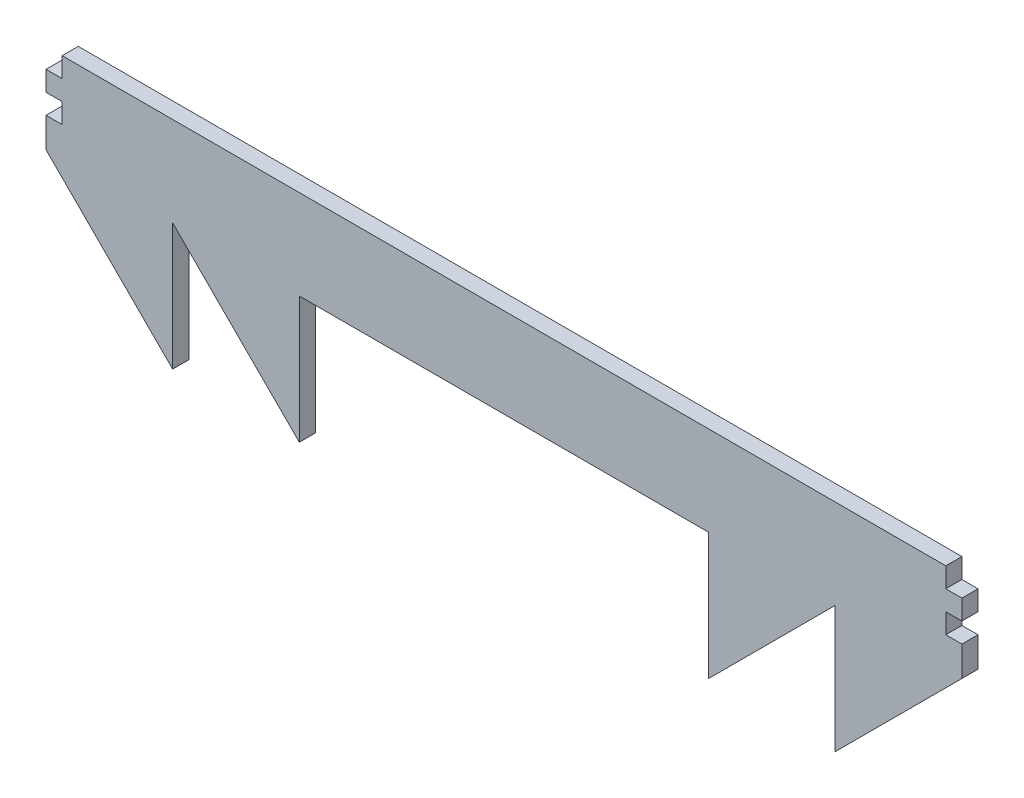
ISO-10303-21;
HEADER;
FILE_DESCRIPTION(('STEP AP214'),'2;1');
FILE_NAME('part.step','',(''),(''),'','','');
FILE_SCHEMA(('AUTOMOTIVE_DESIGN { 1 0 10303 214 1 1 1 1 }'));
ENDSEC;
DATA;
#1=APPLICATION_CONTEXT('core data for automotive mechanical design processes');
#2=APPLICATION_PROTOCOL_DEFINITION('international standard','automotive_design',2000,#1);
#3=PRODUCT_CONTEXT('',#1,'mechanical');
#4=PRODUCT('Part','Part','',(#3));
#5=PRODUCT_RELATED_PRODUCT_CATEGORY('part','',(#4));
#6=PRODUCT_DEFINITION_FORMATION('','',#4);
#7=PRODUCT_DEFINITION_CONTEXT('part definition',#1,'design');
#8=PRODUCT_DEFINITION('design','',#6,#7);
#9=PRODUCT_DEFINITION_SHAPE('','',#8);
#10=(LENGTH_UNIT() NAMED_UNIT(*) SI_UNIT(.MILLI.,.METRE.));
#11=(NAMED_UNIT(*) PLANE_ANGLE_UNIT() SI_UNIT($,.RADIAN.));
#12=(NAMED_UNIT(*) SI_UNIT($,.STERADIAN.) SOLID_ANGLE_UNIT());
#13=UNCERTAINTY_MEASURE_WITH_UNIT(LENGTH_MEASURE(1.E-05),#10,'distance_accuracy_value','');
#14=(GEOMETRIC_REPRESENTATION_CONTEXT(3) GLOBAL_UNCERTAINTY_ASSIGNED_CONTEXT((#13)) GLOBAL_UNIT_ASSIGNED_CONTEXT((#10,
#11,#12)) REPRESENTATION_CONTEXT('',''));
#15=CARTESIAN_POINT('',(0.,0.,0.));
#16=DIRECTION('',(0.,0.,1.));
#17=DIRECTION('',(1.,0.,0.));
#18=AXIS2_PLACEMENT_3D('',#15,#16,#17);
#19=CARTESIAN_POINT('',(76.7,-10.,2.7));
#20=DIRECTION('',(-0.707106781186547,0.707106781186548,0.));
#21=DIRECTION('',(-0.707106781186548,-0.707106781186547,0.));
#22=AXIS2_PLACEMENT_3D('',#19,#20,#21);
#23=PLANE('',#22);
#24=DIRECTION('',(0.707106781186548,0.707106781186547,0.));
#25=VECTOR('',#24,1.);
#26=CARTESIAN_POINT('',(76.7,-10.,0.));
#27=LINE('',#26,#25);
#28=CARTESIAN_POINT('',(55.4867965644036,-31.2132034355964,0.));
#29=VERTEX_POINT('',#28);
#30=CARTESIAN_POINT('',(76.7,-10.,0.));
#31=VERTEX_POINT('',#30);
#32=EDGE_CURVE('E225',#29,#31,#27,.T.);
#33=ORIENTED_EDGE('',*,*,#32,.T.);
#34=DIRECTION('',(0.,0.,-1.));
#35=VECTOR('',#34,1.);
#36=CARTESIAN_POINT('',(76.7,-10.,2.7));
#37=LINE('',#36,#35);
#38=CARTESIAN_POINT('',(76.7,-10.,2.7));
#39=VERTEX_POINT('',#38);
#40=EDGE_CURVE('E11',#39,#31,#37,.T.);
#41=ORIENTED_EDGE('',*,*,#40,.F.);
#42=DIRECTION('',(0.707106781186548,0.707106781186547,0.));
#43=VECTOR('',#42,1.);
#44=CARTESIAN_POINT('',(76.7,-10.,2.7));
#45=LINE('',#44,#43);
#46=CARTESIAN_POINT('',(55.4867965644036,-31.2132034355964,2.7));
#47=VERTEX_POINT('',#46);
#48=EDGE_CURVE('E271',#47,#39,#45,.T.);
#49=ORIENTED_EDGE('',*,*,#48,.F.);
#50=DIRECTION('',(0.,0.,-1.));
#51=VECTOR('',#50,1.);
#52=CARTESIAN_POINT('',(55.4867965644036,-31.2132034355964,2.7));
#53=LINE('',#52,#51);
#54=EDGE_CURVE('E221',#47,#29,#53,.T.);
#55=ORIENTED_EDGE('',*,*,#54,.T.);
#56=EDGE_LOOP('',(#33,#41,#49,#55));
#57=FACE_BOUND('',#56,.T.);
#58=ADVANCED_FACE('F33',(#57),#23,.F.);
#59=CARTESIAN_POINT('',(76.7,-10.,2.7));
#60=DIRECTION('',(-1.,0.,0.));
#61=DIRECTION('',(0.,0.,1.));
#62=AXIS2_PLACEMENT_3D('',#59,#60,#61);
#63=PLANE('',#62);
#64=DIRECTION('',(0.,1.,0.));
#65=VECTOR('',#64,1.);
#66=CARTESIAN_POINT('',(76.7,-10.,0.));
#67=LINE('',#66,#65);
#68=CARTESIAN_POINT('',(76.7,-5.,0.));
#69=VERTEX_POINT('',#68);
#70=EDGE_CURVE('E228',#31,#69,#67,.T.);
#71=ORIENTED_EDGE('',*,*,#70,.T.);
#72=DIRECTION('',(0.,0.,-1.));
#73=VECTOR('',#72,1.);
#74=CARTESIAN_POINT('',(76.7,-5.,2.7));
#75=LINE('',#74,#73);
#76=CARTESIAN_POINT('',(76.7,-5.,2.7));
#77=VERTEX_POINT('',#76);
#78=EDGE_CURVE('E41',#77,#69,#75,.T.);
#79=ORIENTED_EDGE('',*,*,#78,.F.);
#80=DIRECTION('',(0.,1.,0.));
#81=VECTOR('',#80,1.);
#82=CARTESIAN_POINT('',(76.7,-10.,2.7));
#83=LINE('',#82,#81);
#84=EDGE_CURVE('E140',#39,#77,#83,.T.);
#85=ORIENTED_EDGE('',*,*,#84,.F.);
#86=ORIENTED_EDGE('',*,*,#40,.T.);
#87=EDGE_LOOP('',(#71,#79,#85,#86));
#88=FACE_BOUND('',#87,.T.);
#89=ADVANCED_FACE('F409',(#88),#63,.F.);
#90=CARTESIAN_POINT('',(76.7,-5.,2.7));
#91=DIRECTION('',(0.,-1.,0.));
#92=DIRECTION('',(0.,0.,-1.));
#93=AXIS2_PLACEMENT_3D('',#90,#91,#92);
#94=PLANE('',#93);
#95=DIRECTION('',(-1.,0.,0.));
#96=VECTOR('',#95,1.);
#97=CARTESIAN_POINT('',(76.7,-5.,0.));
#98=LINE('',#97,#96);
#99=CARTESIAN_POINT('',(74.,-5.,0.));
#100=VERTEX_POINT('',#99);
#101=EDGE_CURVE('E230',#69,#100,#98,.T.);
#102=ORIENTED_EDGE('',*,*,#101,.T.);
#103=DIRECTION('',(0.,0.,-1.));
#104=VECTOR('',#103,1.);
#105=CARTESIAN_POINT('',(74.,-5.,2.7));
#106=LINE('',#105,#104);
#107=CARTESIAN_POINT('',(74.,-5.,2.7));
#108=VERTEX_POINT('',#107);
#109=EDGE_CURVE('E326',#108,#100,#106,.T.);
#110=ORIENTED_EDGE('',*,*,#109,.F.);
#111=DIRECTION('',(-1.,0.,0.));
#112=VECTOR('',#111,1.);
#113=CARTESIAN_POINT('',(76.7,-5.,2.7));
#114=LINE('',#113,#112);
#115=EDGE_CURVE('E334',#77,#108,#114,.T.);
#116=ORIENTED_EDGE('',*,*,#115,.F.);
#117=ORIENTED_EDGE('',*,*,#78,.T.);
#118=EDGE_LOOP('',(#102,#110,#116,#117));
#119=FACE_BOUND('',#118,.T.);
#120=ADVANCED_FACE('F332',(#119),#94,.F.);
#121=CARTESIAN_POINT('',(74.,-1.66666666666667,2.7));
#122=DIRECTION('',(-1.,0.,0.));
#123=DIRECTION('',(0.,0.,1.));
#124=AXIS2_PLACEMENT_3D('',#121,#122,#123);
#125=PLANE('',#124);
#126=DIRECTION('',(0.,1.,0.));
#127=VECTOR('',#126,1.);
#128=CARTESIAN_POINT('',(74.,-1.66666666666667,0.));
#129=LINE('',#128,#127);
#130=CARTESIAN_POINT('',(74.,-1.66666666666667,0.));
#131=VERTEX_POINT('',#130);
#132=EDGE_CURVE('E232',#100,#131,#129,.T.);
#133=ORIENTED_EDGE('',*,*,#132,.T.);
#134=DIRECTION('',(0.,0.,-1.));
#135=VECTOR('',#134,1.);
#136=CARTESIAN_POINT('',(74.,-1.66666666666667,2.7));
#137=LINE('',#136,#135);
#138=CARTESIAN_POINT('',(74.,-1.66666666666667,2.7));
#139=VERTEX_POINT('',#138);
#140=EDGE_CURVE('E323',#139,#131,#137,.T.);
#141=ORIENTED_EDGE('',*,*,#140,.F.);
#142=DIRECTION('',(0.,1.,0.));
#143=VECTOR('',#142,1.);
#144=CARTESIAN_POINT('',(74.,-1.66666666666667,2.7));
#145=LINE('',#144,#143);
#146=EDGE_CURVE('E352',#108,#139,#145,.T.);
#147=ORIENTED_EDGE('',*,*,#146,.F.);
#148=ORIENTED_EDGE('',*,*,#109,.T.);
#149=EDGE_LOOP('',(#133,#141,#147,#148));
#150=FACE_BOUND('',#149,.T.);
#151=ADVANCED_FACE('F343',(#150),#125,.F.);
#152=CARTESIAN_POINT('',(76.7,-1.66666666666667,2.7));
#153=DIRECTION('',(0.,1.,0.));
#154=DIRECTION('',(-1.,0.,0.));
#155=AXIS2_PLACEMENT_3D('',#152,#153,#154);
#156=PLANE('',#155);
#157=DIRECTION('',(1.,0.,0.));
#158=VECTOR('',#157,1.);
#159=CARTESIAN_POINT('',(76.7,-1.66666666666667,0.));
#160=LINE('',#159,#158);
#161=CARTESIAN_POINT('',(76.7,-1.66666666666667,0.));
#162=VERTEX_POINT('',#161);
#163=EDGE_CURVE('E234',#131,#162,#160,.T.);
#164=ORIENTED_EDGE('',*,*,#163,.T.);
#165=DIRECTION('',(0.,0.,-1.));
#166=VECTOR('',#165,1.);
#167=CARTESIAN_POINT('',(76.7,-1.66666666666667,2.7));
#168=LINE('',#167,#166);
#169=CARTESIAN_POINT('',(76.7,-1.66666666666667,2.7));
#170=VERTEX_POINT('',#169);
#171=EDGE_CURVE('E320',#170,#162,#168,.T.);
#172=ORIENTED_EDGE('',*,*,#171,.F.);
#173=DIRECTION('',(1.,0.,0.));
#174=VECTOR('',#173,1.);
#175=CARTESIAN_POINT('',(76.7,-1.66666666666667,2.7));
#176=LINE('',#175,#174);
#177=EDGE_CURVE('E349',#139,#170,#176,.T.);
#178=ORIENTED_EDGE('',*,*,#177,.F.);
#179=ORIENTED_EDGE('',*,*,#140,.T.);
#180=EDGE_LOOP('',(#164,#172,#178,#179));
#181=FACE_BOUND('',#180,.T.);
#182=ADVANCED_FACE('F347',(#181),#156,.F.);
#183=CARTESIAN_POINT('',(76.7,-1.66666666666667,2.7));
#184=DIRECTION('',(-1.,0.,0.));
#185=DIRECTION('',(0.,0.,1.));
#186=AXIS2_PLACEMENT_3D('',#183,#184,#185);
#187=PLANE('',#186);
#188=DIRECTION('',(0.,1.,0.));
#189=VECTOR('',#188,1.);
#190=CARTESIAN_POINT('',(76.7,-1.66666666666667,0.));
#191=LINE('',#190,#189);
#192=CARTESIAN_POINT('',(76.7,1.66666666666667,0.));
#193=VERTEX_POINT('',#192);
#194=EDGE_CURVE('E236',#162,#193,#191,.T.);
#195=ORIENTED_EDGE('',*,*,#194,.T.);
#196=DIRECTION('',(0.,0.,-1.));
#197=VECTOR('',#196,1.);
#198=CARTESIAN_POINT('',(76.7,1.66666666666667,2.7));
#199=LINE('',#198,#197);
#200=CARTESIAN_POINT('',(76.7,1.66666666666667,2.7));
#201=VERTEX_POINT('',#200);
#202=EDGE_CURVE('E317',#201,#193,#199,.T.);
#203=ORIENTED_EDGE('',*,*,#202,.F.);
#204=DIRECTION('',(0.,1.,0.));
#205=VECTOR('',#204,1.);
#206=CARTESIAN_POINT('',(76.7,-1.66666666666667,2.7));
#207=LINE('',#206,#205);
#208=EDGE_CURVE('E351',#170,#201,#207,.T.);
#209=ORIENTED_EDGE('',*,*,#208,.F.);
#210=ORIENTED_EDGE('',*,*,#171,.T.);
#211=EDGE_LOOP('',(#195,#203,#209,#210));
#212=FACE_BOUND('',#211,.T.);
#213=ADVANCED_FACE('F422',(#212),#187,.F.);
#214=CARTESIAN_POINT('',(76.7,1.66666666666667,2.7));
#215=DIRECTION('',(0.,-1.,0.));
#216=DIRECTION('',(1.,0.,0.));
#217=AXIS2_PLACEMENT_3D('',#214,#215,#216);
#218=PLANE('',#217);
#219=DIRECTION('',(-1.,0.,0.));
#220=VECTOR('',#219,1.);
#221=CARTESIAN_POINT('',(76.7,1.66666666666667,0.));
#222=LINE('',#221,#220);
#223=CARTESIAN_POINT('',(74.,1.66666666666667,0.));
#224=VERTEX_POINT('',#223);
#225=EDGE_CURVE('E238',#193,#224,#222,.T.);
#226=ORIENTED_EDGE('',*,*,#225,.T.);
#227=DIRECTION('',(0.,0.,-1.));
#228=VECTOR('',#227,1.);
#229=CARTESIAN_POINT('',(74.,1.66666666666667,2.7));
#230=LINE('',#229,#228);
#231=CARTESIAN_POINT('',(74.,1.66666666666667,2.7));
#232=VERTEX_POINT('',#231);
#233=EDGE_CURVE('E314',#232,#224,#230,.T.);
#234=ORIENTED_EDGE('',*,*,#233,.F.);
#235=DIRECTION('',(-1.,0.,0.));
#236=VECTOR('',#235,1.);
#237=CARTESIAN_POINT('',(76.7,1.66666666666667,2.7));
#238=LINE('',#237,#236);
#239=EDGE_CURVE('E354',#201,#232,#238,.T.);
#240=ORIENTED_EDGE('',*,*,#239,.F.);
#241=ORIENTED_EDGE('',*,*,#202,.T.);
#242=EDGE_LOOP('',(#226,#234,#240,#241));
#243=FACE_BOUND('',#242,.T.);
#244=ADVANCED_FACE('F425',(#243),#218,.F.);
#245=CARTESIAN_POINT('',(74.,1.66666666666667,2.7));
#246=DIRECTION('',(-1.,0.,0.));
#247=DIRECTION('',(0.,0.,1.));
#248=AXIS2_PLACEMENT_3D('',#245,#246,#247);
#249=PLANE('',#248);
#250=DIRECTION('',(0.,1.,0.));
#251=VECTOR('',#250,1.);
#252=CARTESIAN_POINT('',(74.,1.66666666666667,0.));
#253=LINE('',#252,#251);
#254=CARTESIAN_POINT('',(74.,5.,0.));
#255=VERTEX_POINT('',#254);
#256=EDGE_CURVE('E240',#224,#255,#253,.T.);
#257=ORIENTED_EDGE('',*,*,#256,.T.);
#258=DIRECTION('',(0.,0.,-1.));
#259=VECTOR('',#258,1.);
#260=CARTESIAN_POINT('',(74.,5.,2.7));
#261=LINE('',#260,#259);
#262=CARTESIAN_POINT('',(74.,5.,2.7));
#263=VERTEX_POINT('',#262);
#264=EDGE_CURVE('E311',#263,#255,#261,.T.);
#265=ORIENTED_EDGE('',*,*,#264,.F.);
#266=DIRECTION('',(0.,1.,0.));
#267=VECTOR('',#266,1.);
#268=CARTESIAN_POINT('',(74.,1.66666666666667,2.7));
#269=LINE('',#268,#267);
#270=EDGE_CURVE('E360',#232,#263,#269,.T.);
#271=ORIENTED_EDGE('',*,*,#270,.F.);
#272=ORIENTED_EDGE('',*,*,#233,.T.);
#273=EDGE_LOOP('',(#257,#265,#271,#272));
#274=FACE_BOUND('',#273,.T.);
#275=ADVANCED_FACE('F429',(#274),#249,.F.);
#276=CARTESIAN_POINT('',(74.,5.,2.7));
#277=DIRECTION('',(0.,-1.,0.));
#278=DIRECTION('',(1.,0.,0.));
#279=AXIS2_PLACEMENT_3D('',#276,#277,#278);
#280=PLANE('',#279);
#281=DIRECTION('',(-1.,0.,0.));
#282=VECTOR('',#281,1.);
#283=CARTESIAN_POINT('',(74.,5.,0.));
#284=LINE('',#283,#282);
#285=CARTESIAN_POINT('',(-74.,4.99999999999999,0.));
#286=VERTEX_POINT('',#285);
#287=EDGE_CURVE('E242',#255,#286,#284,.T.);
#288=ORIENTED_EDGE('',*,*,#287,.T.);
#289=DIRECTION('',(0.,0.,-1.));
#290=VECTOR('',#289,1.);
#291=CARTESIAN_POINT('',(-74.,4.99999999999999,2.7));
#292=LINE('',#291,#290);
#293=CARTESIAN_POINT('',(-74.,4.99999999999999,2.7));
#294=VERTEX_POINT('',#293);
#295=EDGE_CURVE('E308',#294,#286,#292,.T.);
#296=ORIENTED_EDGE('',*,*,#295,.F.);
#297=DIRECTION('',(-1.,0.,0.));
#298=VECTOR('',#297,1.);
#299=CARTESIAN_POINT('',(74.,5.,2.7));
#300=LINE('',#299,#298);
#301=EDGE_CURVE('E362',#263,#294,#300,.T.);
#302=ORIENTED_EDGE('',*,*,#301,.F.);
#303=ORIENTED_EDGE('',*,*,#264,.T.);
#304=EDGE_LOOP('',(#288,#296,#302,#303));
#305=FACE_BOUND('',#304,.T.);
#306=ADVANCED_FACE('F433',(#305),#280,.F.);
#307=CARTESIAN_POINT('',(-74.,1.66666666666665,2.7));
#308=DIRECTION('',(1.,0.,0.));
#309=DIRECTION('',(0.,0.,-1.));
#310=AXIS2_PLACEMENT_3D('',#307,#308,#309);
#311=PLANE('',#310);
#312=DIRECTION('',(0.,-1.,0.));
#313=VECTOR('',#312,1.);
#314=CARTESIAN_POINT('',(-74.,1.66666666666665,0.));
#315=LINE('',#314,#313);
#316=CARTESIAN_POINT('',(-74.,1.66666666666665,0.));
#317=VERTEX_POINT('',#316);
#318=EDGE_CURVE('E244',#286,#317,#315,.T.);
#319=ORIENTED_EDGE('',*,*,#318,.T.);
#320=DIRECTION('',(0.,0.,-1.));
#321=VECTOR('',#320,1.);
#322=CARTESIAN_POINT('',(-74.,1.66666666666665,2.7));
#323=LINE('',#322,#321);
#324=CARTESIAN_POINT('',(-74.,1.66666666666665,2.7));
#325=VERTEX_POINT('',#324);
#326=EDGE_CURVE('E305',#325,#317,#323,.T.);
#327=ORIENTED_EDGE('',*,*,#326,.F.);
#328=DIRECTION('',(0.,-1.,0.));
#329=VECTOR('',#328,1.);
#330=CARTESIAN_POINT('',(-74.,1.66666666666665,2.7));
#331=LINE('',#330,#329);
#332=EDGE_CURVE('E364',#294,#325,#331,.T.);
#333=ORIENTED_EDGE('',*,*,#332,.F.);
#334=ORIENTED_EDGE('',*,*,#295,.T.);
#335=EDGE_LOOP('',(#319,#327,#333,#334));
#336=FACE_BOUND('',#335,.T.);
#337=ADVANCED_FACE('F437',(#336),#311,.F.);
#338=CARTESIAN_POINT('',(-76.7,1.66666666666665,2.7));
#339=DIRECTION('',(0.,-1.,0.));
#340=DIRECTION('',(1.,0.,0.));
#341=AXIS2_PLACEMENT_3D('',#338,#339,#340);
#342=PLANE('',#341);
#343=DIRECTION('',(-1.,0.,0.));
#344=VECTOR('',#343,1.);
#345=CARTESIAN_POINT('',(-76.7,1.66666666666665,0.));
#346=LINE('',#345,#344);
#347=CARTESIAN_POINT('',(-76.7,1.66666666666665,0.));
#348=VERTEX_POINT('',#347);
#349=EDGE_CURVE('E246',#317,#348,#346,.T.);
#350=ORIENTED_EDGE('',*,*,#349,.T.);
#351=DIRECTION('',(0.,0.,-1.));
#352=VECTOR('',#351,1.);
#353=CARTESIAN_POINT('',(-76.7,1.66666666666665,2.7));
#354=LINE('',#353,#352);
#355=CARTESIAN_POINT('',(-76.7,1.66666666666665,2.7));
#356=VERTEX_POINT('',#355);
#357=EDGE_CURVE('E302',#356,#348,#354,.T.);
#358=ORIENTED_EDGE('',*,*,#357,.F.);
#359=DIRECTION('',(-1.,0.,0.));
#360=VECTOR('',#359,1.);
#361=CARTESIAN_POINT('',(-76.7,1.66666666666665,2.7));
#362=LINE('',#361,#360);
#363=EDGE_CURVE('E366',#325,#356,#362,.T.);
#364=ORIENTED_EDGE('',*,*,#363,.F.);
#365=ORIENTED_EDGE('',*,*,#326,.T.);
#366=EDGE_LOOP('',(#350,#358,#364,#365));
#367=FACE_BOUND('',#366,.T.);
#368=ADVANCED_FACE('F441',(#367),#342,.F.);
#369=CARTESIAN_POINT('',(-76.7,-1.66666666666668,2.7));
#370=DIRECTION('',(1.,0.,0.));
#371=DIRECTION('',(0.,0.,-1.));
#372=AXIS2_PLACEMENT_3D('',#369,#370,#371);
#373=PLANE('',#372);
#374=DIRECTION('',(0.,-1.,0.));
#375=VECTOR('',#374,1.);
#376=CARTESIAN_POINT('',(-76.7,-1.66666666666668,0.));
#377=LINE('',#376,#375);
#378=CARTESIAN_POINT('',(-76.7,-1.66666666666668,0.));
#379=VERTEX_POINT('',#378);
#380=EDGE_CURVE('E248',#348,#379,#377,.T.);
#381=ORIENTED_EDGE('',*,*,#380,.T.);
#382=DIRECTION('',(0.,0.,-1.));
#383=VECTOR('',#382,1.);
#384=CARTESIAN_POINT('',(-76.7,-1.66666666666668,2.7));
#385=LINE('',#384,#383);
#386=CARTESIAN_POINT('',(-76.7,-1.66666666666668,2.7));
#387=VERTEX_POINT('',#386);
#388=EDGE_CURVE('E299',#387,#379,#385,.T.);
#389=ORIENTED_EDGE('',*,*,#388,.F.);
#390=DIRECTION('',(0.,-1.,0.));
#391=VECTOR('',#390,1.);
#392=CARTESIAN_POINT('',(-76.7,-1.66666666666668,2.7));
#393=LINE('',#392,#391);
#394=EDGE_CURVE('E368',#356,#387,#393,.T.);
#395=ORIENTED_EDGE('',*,*,#394,.F.);
#396=ORIENTED_EDGE('',*,*,#357,.T.);
#397=EDGE_LOOP('',(#381,#389,#395,#396));
#398=FACE_BOUND('',#397,.T.);
#399=ADVANCED_FACE('F445',(#398),#373,.F.);
#400=CARTESIAN_POINT('',(-76.7,-1.66666666666668,2.7));
#401=DIRECTION('',(0.,1.,0.));
#402=DIRECTION('',(0.,0.,1.));
#403=AXIS2_PLACEMENT_3D('',#400,#401,#402);
#404=PLANE('',#403);
#405=DIRECTION('',(1.,0.,0.));
#406=VECTOR('',#405,1.);
#407=CARTESIAN_POINT('',(-76.7,-1.66666666666668,0.));
#408=LINE('',#407,#406);
#409=CARTESIAN_POINT('',(-74.,-1.66666666666668,0.));
#410=VERTEX_POINT('',#409);
#411=EDGE_CURVE('E250',#379,#410,#408,.T.);
#412=ORIENTED_EDGE('',*,*,#411,.T.);
#413=DIRECTION('',(0.,0.,-1.));
#414=VECTOR('',#413,1.);
#415=CARTESIAN_POINT('',(-74.,-1.66666666666668,2.7));
#416=LINE('',#415,#414);
#417=CARTESIAN_POINT('',(-74.,-1.66666666666668,2.7));
#418=VERTEX_POINT('',#417);
#419=EDGE_CURVE('E296',#418,#410,#416,.T.);
#420=ORIENTED_EDGE('',*,*,#419,.F.);
#421=DIRECTION('',(1.,0.,0.));
#422=VECTOR('',#421,1.);
#423=CARTESIAN_POINT('',(-76.7,-1.66666666666668,2.7));
#424=LINE('',#423,#422);
#425=EDGE_CURVE('E370',#387,#418,#424,.T.);
#426=ORIENTED_EDGE('',*,*,#425,.F.);
#427=ORIENTED_EDGE('',*,*,#388,.T.);
#428=EDGE_LOOP('',(#412,#420,#426,#427));
#429=FACE_BOUND('',#428,.T.);
#430=ADVANCED_FACE('F449',(#429),#404,.F.);
#431=CARTESIAN_POINT('',(-74.,-1.66666666666668,2.7));
#432=DIRECTION('',(1.,0.,0.));
#433=DIRECTION('',(0.,0.,-1.));
#434=AXIS2_PLACEMENT_3D('',#431,#432,#433);
#435=PLANE('',#434);
#436=DIRECTION('',(0.,-1.,0.));
#437=VECTOR('',#436,1.);
#438=CARTESIAN_POINT('',(-74.,-1.66666666666668,0.));
#439=LINE('',#438,#437);
#440=CARTESIAN_POINT('',(-74.,-5.00000000000002,0.));
#441=VERTEX_POINT('',#440);
#442=EDGE_CURVE('E252',#410,#441,#439,.T.);
#443=ORIENTED_EDGE('',*,*,#442,.T.);
#444=DIRECTION('',(0.,0.,-1.));
#445=VECTOR('',#444,1.);
#446=CARTESIAN_POINT('',(-74.,-5.00000000000002,2.7));
#447=LINE('',#446,#445);
#448=CARTESIAN_POINT('',(-74.,-5.00000000000002,2.7));
#449=VERTEX_POINT('',#448);
#450=EDGE_CURVE('E293',#449,#441,#447,.T.);
#451=ORIENTED_EDGE('',*,*,#450,.F.);
#452=DIRECTION('',(0.,-1.,0.));
#453=VECTOR('',#452,1.);
#454=CARTESIAN_POINT('',(-74.,-1.66666666666668,2.7));
#455=LINE('',#454,#453);
#456=EDGE_CURVE('E372',#418,#449,#455,.T.);
#457=ORIENTED_EDGE('',*,*,#456,.F.);
#458=ORIENTED_EDGE('',*,*,#419,.T.);
#459=EDGE_LOOP('',(#443,#451,#457,#458));
#460=FACE_BOUND('',#459,.T.);
#461=ADVANCED_FACE('F453',(#460),#435,.F.);
#462=CARTESIAN_POINT('',(-74.,-5.00000000000002,2.7));
#463=DIRECTION('',(0.,-1.,0.));
#464=DIRECTION('',(0.,0.,-1.));
#465=AXIS2_PLACEMENT_3D('',#462,#463,#464);
#466=PLANE('',#465);
#467=DIRECTION('',(-1.,0.,0.));
#468=VECTOR('',#467,1.);
#469=CARTESIAN_POINT('',(-74.,-5.00000000000002,0.));
#470=LINE('',#469,#468);
#471=CARTESIAN_POINT('',(-76.7,-5.00000000000002,0.));
#472=VERTEX_POINT('',#471);
#473=EDGE_CURVE('E254',#441,#472,#470,.T.);
#474=ORIENTED_EDGE('',*,*,#473,.T.);
#475=DIRECTION('',(0.,0.,-1.));
#476=VECTOR('',#475,1.);
#477=CARTESIAN_POINT('',(-76.7,-5.00000000000002,2.7));
#478=LINE('',#477,#476);
#479=CARTESIAN_POINT('',(-76.7,-5.00000000000002,2.7));
#480=VERTEX_POINT('',#479);
#481=EDGE_CURVE('E290',#480,#472,#478,.T.);
#482=ORIENTED_EDGE('',*,*,#481,.F.);
#483=DIRECTION('',(-1.,0.,0.));
#484=VECTOR('',#483,1.);
#485=CARTESIAN_POINT('',(-74.,-5.00000000000002,2.7));
#486=LINE('',#485,#484);
#487=EDGE_CURVE('E374',#449,#480,#486,.T.);
#488=ORIENTED_EDGE('',*,*,#487,.F.);
#489=ORIENTED_EDGE('',*,*,#450,.T.);
#490=EDGE_LOOP('',(#474,#482,#488,#489));
#491=FACE_BOUND('',#490,.T.);
#492=ADVANCED_FACE('F457',(#491),#466,.F.);
#493=CARTESIAN_POINT('',(-76.7,-5.00000000000002,2.7));
#494=DIRECTION('',(1.,0.,0.));
#495=DIRECTION('',(0.,0.,-1.));
#496=AXIS2_PLACEMENT_3D('',#493,#494,#495);
#497=PLANE('',#496);
#498=DIRECTION('',(0.,-1.,0.));
#499=VECTOR('',#498,1.);
#500=CARTESIAN_POINT('',(-76.7,-5.00000000000002,0.));
#501=LINE('',#500,#499);
#502=CARTESIAN_POINT('',(-76.7,-10.,0.));
#503=VERTEX_POINT('',#502);
#504=EDGE_CURVE('E256',#472,#503,#501,.T.);
#505=ORIENTED_EDGE('',*,*,#504,.T.);
#506=DIRECTION('',(0.,0.,-1.));
#507=VECTOR('',#506,1.);
#508=CARTESIAN_POINT('',(-76.7,-10.,2.7));
#509=LINE('',#508,#507);
#510=CARTESIAN_POINT('',(-76.7,-10.,2.7));
#511=VERTEX_POINT('',#510);
#512=EDGE_CURVE('E287',#511,#503,#509,.T.);
#513=ORIENTED_EDGE('',*,*,#512,.F.);
#514=DIRECTION('',(0.,-1.,0.));
#515=VECTOR('',#514,1.);
#516=CARTESIAN_POINT('',(-76.7,-5.00000000000002,2.7));
#517=LINE('',#516,#515);
#518=EDGE_CURVE('E376',#480,#511,#517,.T.);
#519=ORIENTED_EDGE('',*,*,#518,.F.);
#520=ORIENTED_EDGE('',*,*,#481,.T.);
#521=EDGE_LOOP('',(#505,#513,#519,#520));
#522=FACE_BOUND('',#521,.T.);
#523=ADVANCED_FACE('F461',(#522),#497,.F.);
#524=CARTESIAN_POINT('',(-76.7,-10.,2.7));
#525=DIRECTION('',(0.707106781186548,0.707106781186547,0.));
#526=DIRECTION('',(-0.707106781186547,0.707106781186548,0.));
#527=AXIS2_PLACEMENT_3D('',#524,#525,#526);
#528=PLANE('',#527);
#529=DIRECTION('',(0.707106781186547,-0.707106781186547,0.));
#530=VECTOR('',#529,1.);
#531=CARTESIAN_POINT('',(-76.7,-10.,0.));
#532=LINE('',#531,#530);
#533=CARTESIAN_POINT('',(-55.4867965644036,-31.2132034355964,0.));
#534=VERTEX_POINT('',#533);
#535=EDGE_CURVE('E258',#503,#534,#532,.T.);
#536=ORIENTED_EDGE('',*,*,#535,.T.);
#537=DIRECTION('',(0.,0.,-1.));
#538=VECTOR('',#537,1.);
#539=CARTESIAN_POINT('',(-55.4867965644036,-31.2132034355964,2.7));
#540=LINE('',#539,#538);
#541=CARTESIAN_POINT('',(-55.4867965644036,-31.2132034355964,2.7));
#542=VERTEX_POINT('',#541);
#543=EDGE_CURVE('E284',#542,#534,#540,.T.);
#544=ORIENTED_EDGE('',*,*,#543,.F.);
#545=DIRECTION('',(0.707106781186547,-0.707106781186547,0.));
#546=VECTOR('',#545,1.);
#547=CARTESIAN_POINT('',(-76.7,-10.,2.7));
#548=LINE('',#547,#546);
#549=EDGE_CURVE('E378',#511,#542,#548,.T.);
#550=ORIENTED_EDGE('',*,*,#549,.F.);
#551=ORIENTED_EDGE('',*,*,#512,.T.);
#552=EDGE_LOOP('',(#536,#544,#550,#551));
#553=FACE_BOUND('',#552,.T.);
#554=ADVANCED_FACE('F465',(#553),#528,.F.);
#555=CARTESIAN_POINT('',(-55.4867965644036,-31.2132034355964,2.7));
#556=DIRECTION('',(-1.,0.,0.));
#557=DIRECTION('',(0.,0.,1.));
#558=AXIS2_PLACEMENT_3D('',#555,#556,#557);
#559=PLANE('',#558);
#560=DIRECTION('',(0.,1.,0.));
#561=VECTOR('',#560,1.);
#562=CARTESIAN_POINT('',(-55.4867965644036,-31.2132034355964,0.));
#563=LINE('',#562,#561);
#564=CARTESIAN_POINT('',(-55.4867965644036,-10.,0.));
#565=VERTEX_POINT('',#564);
#566=EDGE_CURVE('E260',#534,#565,#563,.T.);
#567=ORIENTED_EDGE('',*,*,#566,.T.);
#568=DIRECTION('',(0.,0.,-1.));
#569=VECTOR('',#568,1.);
#570=CARTESIAN_POINT('',(-55.4867965644036,-10.,2.7));
#571=LINE('',#570,#569);
#572=CARTESIAN_POINT('',(-55.4867965644036,-10.,2.7));
#573=VERTEX_POINT('',#572);
#574=EDGE_CURVE('E281',#573,#565,#571,.T.);
#575=ORIENTED_EDGE('',*,*,#574,.F.);
#576=DIRECTION('',(0.,1.,0.));
#577=VECTOR('',#576,1.);
#578=CARTESIAN_POINT('',(-55.4867965644036,-31.2132034355964,2.7));
#579=LINE('',#578,#577);
#580=EDGE_CURVE('E380',#542,#573,#579,.T.);
#581=ORIENTED_EDGE('',*,*,#580,.F.);
#582=ORIENTED_EDGE('',*,*,#543,.T.);
#583=EDGE_LOOP('',(#567,#575,#581,#582));
#584=FACE_BOUND('',#583,.T.);
#585=ADVANCED_FACE('F469',(#584),#559,.F.);
#586=CARTESIAN_POINT('',(-55.4867965644036,-10.,2.7));
#587=DIRECTION('',(0.707106781186547,0.707106781186548,0.));
#588=DIRECTION('',(-0.707106781186548,0.707106781186547,0.));
#589=AXIS2_PLACEMENT_3D('',#586,#587,#588);
#590=PLANE('',#589);
#591=DIRECTION('',(0.707106781186548,-0.707106781186547,0.));
#592=VECTOR('',#591,1.);
#593=CARTESIAN_POINT('',(-55.4867965644036,-10.,0.));
#594=LINE('',#593,#592);
#595=CARTESIAN_POINT('',(-34.2735931288071,-31.2132034355964,0.));
#596=VERTEX_POINT('',#595);
#597=EDGE_CURVE('E262',#565,#596,#594,.T.);
#598=ORIENTED_EDGE('',*,*,#597,.T.);
#599=DIRECTION('',(0.,0.,-1.));
#600=VECTOR('',#599,1.);
#601=CARTESIAN_POINT('',(-34.2735931288071,-31.2132034355964,2.7));
#602=LINE('',#601,#600);
#603=CARTESIAN_POINT('',(-34.2735931288071,-31.2132034355964,2.7));
#604=VERTEX_POINT('',#603);
#605=EDGE_CURVE('E278',#604,#596,#602,.T.);
#606=ORIENTED_EDGE('',*,*,#605,.F.);
#607=DIRECTION('',(0.707106781186548,-0.707106781186547,0.));
#608=VECTOR('',#607,1.);
#609=CARTESIAN_POINT('',(-55.4867965644036,-10.,2.7));
#610=LINE('',#609,#608);
#611=EDGE_CURVE('E382',#573,#604,#610,.T.);
#612=ORIENTED_EDGE('',*,*,#611,.F.);
#613=ORIENTED_EDGE('',*,*,#574,.T.);
#614=EDGE_LOOP('',(#598,#606,#612,#613));
#615=FACE_BOUND('',#614,.T.);
#616=ADVANCED_FACE('F473',(#615),#590,.F.);
#617=CARTESIAN_POINT('',(-34.2735931288071,-31.2132034355964,2.7));
#618=DIRECTION('',(-1.,0.,0.));
#619=DIRECTION('',(0.,0.,1.));
#620=AXIS2_PLACEMENT_3D('',#617,#618,#619);
#621=PLANE('',#620);
#622=DIRECTION('',(0.,1.,0.));
#623=VECTOR('',#622,1.);
#624=CARTESIAN_POINT('',(-34.2735931288071,-31.2132034355964,0.));
#625=LINE('',#624,#623);
#626=CARTESIAN_POINT('',(-34.2735931288071,-10.,0.));
#627=VERTEX_POINT('',#626);
#628=EDGE_CURVE('E264',#596,#627,#625,.T.);
#629=ORIENTED_EDGE('',*,*,#628,.T.);
#630=DIRECTION('',(0.,0.,-1.));
#631=VECTOR('',#630,1.);
#632=CARTESIAN_POINT('',(-34.2735931288071,-10.,2.7));
#633=LINE('',#632,#631);
#634=CARTESIAN_POINT('',(-34.2735931288071,-10.,2.7));
#635=VERTEX_POINT('',#634);
#636=EDGE_CURVE('E275',#635,#627,#633,.T.);
#637=ORIENTED_EDGE('',*,*,#636,.F.);
#638=DIRECTION('',(0.,1.,0.));
#639=VECTOR('',#638,1.);
#640=CARTESIAN_POINT('',(-34.2735931288071,-31.2132034355964,2.7));
#641=LINE('',#640,#639);
#642=EDGE_CURVE('E384',#604,#635,#641,.T.);
#643=ORIENTED_EDGE('',*,*,#642,.F.);
#644=ORIENTED_EDGE('',*,*,#605,.T.);
#645=EDGE_LOOP('',(#629,#637,#643,#644));
#646=FACE_BOUND('',#645,.T.);
#647=ADVANCED_FACE('F390',(#646),#621,.F.);
#648=CARTESIAN_POINT('',(-34.2735931288071,-10.,2.7));
#649=DIRECTION('',(0.,1.,0.));
#650=DIRECTION('',(0.,0.,1.));
#651=AXIS2_PLACEMENT_3D('',#648,#649,#650);
#652=PLANE('',#651);
#653=DIRECTION('',(1.,0.,0.));
#654=VECTOR('',#653,1.);
#655=CARTESIAN_POINT('',(-34.2735931288071,-10.,0.));
#656=LINE('',#655,#654);
#657=CARTESIAN_POINT('',(34.2735931288071,-10.,0.));
#658=VERTEX_POINT('',#657);
#659=EDGE_CURVE('E266',#627,#658,#656,.T.);
#660=ORIENTED_EDGE('',*,*,#659,.T.);
#661=DIRECTION('',(0.,0.,-1.));
#662=VECTOR('',#661,1.);
#663=CARTESIAN_POINT('',(34.2735931288071,-10.,2.7));
#664=LINE('',#663,#662);
#665=CARTESIAN_POINT('',(34.2735931288071,-10.,2.7));
#666=VERTEX_POINT('',#665);
#667=EDGE_CURVE('E216',#666,#658,#664,.T.);
#668=ORIENTED_EDGE('',*,*,#667,.F.);
#669=DIRECTION('',(1.,0.,0.));
#670=VECTOR('',#669,1.);
#671=CARTESIAN_POINT('',(-34.2735931288071,-10.,2.7));
#672=LINE('',#671,#670);
#673=EDGE_CURVE('E207',#635,#666,#672,.T.);
#674=ORIENTED_EDGE('',*,*,#673,.F.);
#675=ORIENTED_EDGE('',*,*,#636,.T.);
#676=EDGE_LOOP('',(#660,#668,#674,#675));
#677=FACE_BOUND('',#676,.T.);
#678=ADVANCED_FACE('F394',(#677),#652,.F.);
#679=CARTESIAN_POINT('',(34.2735931288071,-31.2132034355964,2.7));
#680=DIRECTION('',(1.,0.,0.));
#681=DIRECTION('',(0.,0.,-1.));
#682=AXIS2_PLACEMENT_3D('',#679,#680,#681);
#683=PLANE('',#682);
#684=DIRECTION('',(0.,-1.,0.));
#685=VECTOR('',#684,1.);
#686=CARTESIAN_POINT('',(34.2735931288071,-31.2132034355964,0.));
#687=LINE('',#686,#685);
#688=CARTESIAN_POINT('',(34.2735931288071,-31.2132034355964,0.));
#689=VERTEX_POINT('',#688);
#690=EDGE_CURVE('E215',#658,#689,#687,.T.);
#691=ORIENTED_EDGE('',*,*,#690,.T.);
#692=DIRECTION('',(0.,0.,-1.));
#693=VECTOR('',#692,1.);
#694=CARTESIAN_POINT('',(34.2735931288071,-31.2132034355964,2.7));
#695=LINE('',#694,#693);
#696=CARTESIAN_POINT('',(34.2735931288071,-31.2132034355964,2.7));
#697=VERTEX_POINT('',#696);
#698=EDGE_CURVE('E212',#697,#689,#695,.T.);
#699=ORIENTED_EDGE('',*,*,#698,.F.);
#700=DIRECTION('',(0.,-1.,0.));
#701=VECTOR('',#700,1.);
#702=CARTESIAN_POINT('',(34.2735931288071,-31.2132034355964,2.7));
#703=LINE('',#702,#701);
#704=EDGE_CURVE('E201',#666,#697,#703,.T.);
#705=ORIENTED_EDGE('',*,*,#704,.F.);
#706=ORIENTED_EDGE('',*,*,#667,.T.);
#707=EDGE_LOOP('',(#691,#699,#705,#706));
#708=FACE_BOUND('',#707,.T.);
#709=ADVANCED_FACE('F213',(#708),#683,.F.);
#710=CARTESIAN_POINT('',(55.4867965644036,-10.,2.7));
#711=DIRECTION('',(-0.707106781186547,0.707106781186548,0.));
#712=DIRECTION('',(-0.707106781186548,-0.707106781186547,0.));
#713=AXIS2_PLACEMENT_3D('',#710,#711,#712);
#714=PLANE('',#713);
#715=DIRECTION('',(0.707106781186548,0.707106781186547,0.));
#716=VECTOR('',#715,1.);
#717=CARTESIAN_POINT('',(55.4867965644036,-10.,0.));
#718=LINE('',#717,#716);
#719=CARTESIAN_POINT('',(55.4867965644036,-10.,0.));
#720=VERTEX_POINT('',#719);
#721=EDGE_CURVE('E126',#689,#720,#718,.T.);
#722=ORIENTED_EDGE('',*,*,#721,.T.);
#723=DIRECTION('',(0.,0.,-1.));
#724=VECTOR('',#723,1.);
#725=CARTESIAN_POINT('',(55.4867965644036,-10.,2.7));
#726=LINE('',#725,#724);
#727=CARTESIAN_POINT('',(55.4867965644036,-10.,2.7));
#728=VERTEX_POINT('',#727);
#729=EDGE_CURVE('E217',#728,#720,#726,.T.);
#730=ORIENTED_EDGE('',*,*,#729,.F.);
#731=DIRECTION('',(0.707106781186548,0.707106781186547,0.));
#732=VECTOR('',#731,1.);
#733=CARTESIAN_POINT('',(55.4867965644036,-10.,2.7));
#734=LINE('',#733,#732);
#735=EDGE_CURVE('E205',#697,#728,#734,.T.);
#736=ORIENTED_EDGE('',*,*,#735,.F.);
#737=ORIENTED_EDGE('',*,*,#698,.T.);
#738=EDGE_LOOP('',(#722,#730,#736,#737));
#739=FACE_BOUND('',#738,.T.);
#740=ADVANCED_FACE('F219',(#739),#714,.F.);
#741=CARTESIAN_POINT('',(55.4867965644036,-31.2132034355964,2.7));
#742=DIRECTION('',(1.,0.,0.));
#743=DIRECTION('',(0.,0.,-1.));
#744=AXIS2_PLACEMENT_3D('',#741,#742,#743);
#745=PLANE('',#744);
#746=DIRECTION('',(0.,-1.,0.));
#747=VECTOR('',#746,1.);
#748=CARTESIAN_POINT('',(55.4867965644036,-31.2132034355964,0.));
#749=LINE('',#748,#747);
#750=EDGE_CURVE('E132',#720,#29,#749,.T.);
#751=ORIENTED_EDGE('',*,*,#750,.T.);
#752=ORIENTED_EDGE('',*,*,#54,.F.);
#753=DIRECTION('',(0.,-1.,0.));
#754=VECTOR('',#753,1.);
#755=CARTESIAN_POINT('',(55.4867965644036,-31.2132034355964,2.7));
#756=LINE('',#755,#754);
#757=EDGE_CURVE('E49',#728,#47,#756,.T.);
#758=ORIENTED_EDGE('',*,*,#757,.F.);
#759=ORIENTED_EDGE('',*,*,#729,.T.);
#760=EDGE_LOOP('',(#751,#752,#758,#759));
#761=FACE_BOUND('',#760,.T.);
#762=ADVANCED_FACE('F398',(#761),#745,.F.);
#763=CARTESIAN_POINT('',(0.,0.,2.7));
#764=DIRECTION('',(0.,0.,1.));
#765=DIRECTION('',(1.,0.,0.));
#766=AXIS2_PLACEMENT_3D('',#763,#764,#765);
#767=PLANE('',#766);
#768=ORIENTED_EDGE('',*,*,#48,.T.);
#769=ORIENTED_EDGE('',*,*,#84,.T.);
#770=ORIENTED_EDGE('',*,*,#115,.T.);
#771=ORIENTED_EDGE('',*,*,#146,.T.);
#772=ORIENTED_EDGE('',*,*,#177,.T.);
#773=ORIENTED_EDGE('',*,*,#208,.T.);
#774=ORIENTED_EDGE('',*,*,#239,.T.);
#775=ORIENTED_EDGE('',*,*,#270,.T.);
#776=ORIENTED_EDGE('',*,*,#301,.T.);
#777=ORIENTED_EDGE('',*,*,#332,.T.);
#778=ORIENTED_EDGE('',*,*,#363,.T.);
#779=ORIENTED_EDGE('',*,*,#394,.T.);
#780=ORIENTED_EDGE('',*,*,#425,.T.);
#781=ORIENTED_EDGE('',*,*,#456,.T.);
#782=ORIENTED_EDGE('',*,*,#487,.T.);
#783=ORIENTED_EDGE('',*,*,#518,.T.);
#784=ORIENTED_EDGE('',*,*,#549,.T.);
#785=ORIENTED_EDGE('',*,*,#580,.T.);
#786=ORIENTED_EDGE('',*,*,#611,.T.);
#787=ORIENTED_EDGE('',*,*,#642,.T.);
#788=ORIENTED_EDGE('',*,*,#673,.T.);
#789=ORIENTED_EDGE('',*,*,#704,.T.);
#790=ORIENTED_EDGE('',*,*,#735,.T.);
#791=ORIENTED_EDGE('',*,*,#757,.T.);
#792=EDGE_LOOP('',(#768,#769,#770,#771,#772,#773,#774,#775,#776,#777,#778,#779,#780,#781,#782,
#783,#784,#785,#786,#787,#788,#789,#790,#791));
#793=FACE_BOUND('',#792,.T.);
#794=ADVANCED_FACE('F203',(#793),#767,.T.);
#795=CARTESIAN_POINT('',(0.,0.,0.));
#796=DIRECTION('',(0.,0.,1.));
#797=DIRECTION('',(1.,0.,0.));
#798=AXIS2_PLACEMENT_3D('',#795,#796,#797);
#799=PLANE('',#798);
#800=ORIENTED_EDGE('',*,*,#32,.F.);
#801=ORIENTED_EDGE('',*,*,#750,.F.);
#802=ORIENTED_EDGE('',*,*,#721,.F.);
#803=ORIENTED_EDGE('',*,*,#690,.F.);
#804=ORIENTED_EDGE('',*,*,#659,.F.);
#805=ORIENTED_EDGE('',*,*,#628,.F.);
#806=ORIENTED_EDGE('',*,*,#597,.F.);
#807=ORIENTED_EDGE('',*,*,#566,.F.);
#808=ORIENTED_EDGE('',*,*,#535,.F.);
#809=ORIENTED_EDGE('',*,*,#504,.F.);
#810=ORIENTED_EDGE('',*,*,#473,.F.);
#811=ORIENTED_EDGE('',*,*,#442,.F.);
#812=ORIENTED_EDGE('',*,*,#411,.F.);
#813=ORIENTED_EDGE('',*,*,#380,.F.);
#814=ORIENTED_EDGE('',*,*,#349,.F.);
#815=ORIENTED_EDGE('',*,*,#318,.F.);
#816=ORIENTED_EDGE('',*,*,#287,.F.);
#817=ORIENTED_EDGE('',*,*,#256,.F.);
#818=ORIENTED_EDGE('',*,*,#225,.F.);
#819=ORIENTED_EDGE('',*,*,#194,.F.);
#820=ORIENTED_EDGE('',*,*,#163,.F.);
#821=ORIENTED_EDGE('',*,*,#132,.F.);
#822=ORIENTED_EDGE('',*,*,#101,.F.);
#823=ORIENTED_EDGE('',*,*,#70,.F.);
#824=EDGE_LOOP('',(#800,#801,#802,#803,#804,#805,#806,#807,#808,#809,#810,#811,#812,#813,#814,
#815,#816,#817,#818,#819,#820,#821,#822,#823));
#825=FACE_BOUND('',#824,.T.);
#826=ADVANCED_FACE('F338',(#825),#799,.F.);
#827=CLOSED_SHELL('',(#58,#89,#120,#151,#182,#213,#244,#275,#306,#337,#368,#399,#430,#461,#492,
#523,#554,#585,#616,#647,#678,#709,#740,#762,#794,#826));
#828=MANIFOLD_SOLID_BREP('B2',#827);
#829=ADVANCED_BREP_SHAPE_REPRESENTATION('',(#18,#828),#14);
#830=SHAPE_DEFINITION_REPRESENTATION(#9,#829);
ENDSEC;
END-ISO-10303-21;
